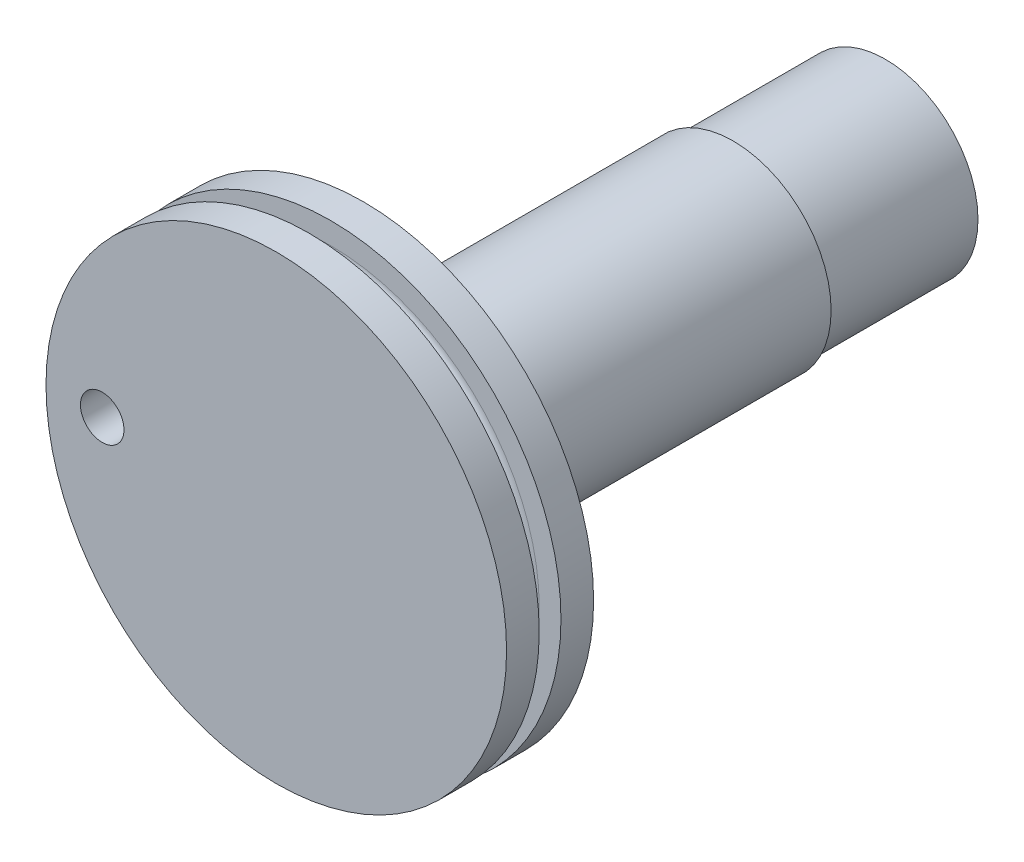
ISO-10303-21;
HEADER;
FILE_DESCRIPTION(('STEP AP214'),'2;1');
FILE_NAME('part.step','',(''),(''),'','','');
FILE_SCHEMA(('AUTOMOTIVE_DESIGN { 1 0 10303 214 1 1 1 1 }'));
ENDSEC;
DATA;
#1=APPLICATION_CONTEXT('core data for automotive mechanical design processes');
#2=APPLICATION_PROTOCOL_DEFINITION('international standard','automotive_design',2000,#1);
#3=PRODUCT_CONTEXT('',#1,'mechanical');
#4=PRODUCT('Part','Part','',(#3));
#5=PRODUCT_RELATED_PRODUCT_CATEGORY('part','',(#4));
#6=PRODUCT_DEFINITION_FORMATION('','',#4);
#7=PRODUCT_DEFINITION_CONTEXT('part definition',#1,'design');
#8=PRODUCT_DEFINITION('design','',#6,#7);
#9=PRODUCT_DEFINITION_SHAPE('','',#8);
#10=(LENGTH_UNIT() NAMED_UNIT(*) SI_UNIT(.MILLI.,.METRE.));
#11=(NAMED_UNIT(*) PLANE_ANGLE_UNIT() SI_UNIT($,.RADIAN.));
#12=(NAMED_UNIT(*) SI_UNIT($,.STERADIAN.) SOLID_ANGLE_UNIT());
#13=UNCERTAINTY_MEASURE_WITH_UNIT(LENGTH_MEASURE(1.E-05),#10,'distance_accuracy_value','');
#14=(GEOMETRIC_REPRESENTATION_CONTEXT(3) GLOBAL_UNCERTAINTY_ASSIGNED_CONTEXT((#13)) GLOBAL_UNIT_ASSIGNED_CONTEXT((#10,
#11,#12)) REPRESENTATION_CONTEXT('',''));
#15=CARTESIAN_POINT('',(0.,0.,0.));
#16=DIRECTION('',(0.,0.,1.));
#17=DIRECTION('',(1.,0.,0.));
#18=AXIS2_PLACEMENT_3D('',#15,#16,#17);
#19=CARTESIAN_POINT('',(21.,71.5,28.));
#20=DIRECTION('',(0.,0.,-1.));
#21=DIRECTION('',(-1.,0.,0.));
#22=AXIS2_PLACEMENT_3D('',#19,#20,#21);
#23=CYLINDRICAL_SURFACE('',#22,4.5);
#24=CARTESIAN_POINT('',(21.,71.5,7.));
#25=DIRECTION('',(0.,0.,1.));
#26=DIRECTION('',(1.,0.,0.));
#27=AXIS2_PLACEMENT_3D('',#24,#25,#26);
#28=CIRCLE('',#27,4.5);
#29=CARTESIAN_POINT('',(25.5,71.5,7.));
#30=VERTEX_POINT('',#29);
#31=EDGE_CURVE('E46',#30,#30,#28,.T.);
#32=ORIENTED_EDGE('',*,*,#31,.T.);
#33=EDGE_LOOP('',(#32));
#34=FACE_BOUND('',#33,.T.);
#35=CARTESIAN_POINT('',(21.,71.5,24.));
#36=DIRECTION('',(0.,0.,1.));
#37=DIRECTION('',(1.,0.,0.));
#38=AXIS2_PLACEMENT_3D('',#35,#36,#37);
#39=CIRCLE('',#38,4.5);
#40=CARTESIAN_POINT('',(25.5,71.5,24.));
#41=VERTEX_POINT('',#40);
#42=EDGE_CURVE('E10',#41,#41,#39,.T.);
#43=ORIENTED_EDGE('',*,*,#42,.F.);
#44=EDGE_LOOP('',(#43));
#45=FACE_BOUND('',#44,.T.);
#46=ADVANCED_FACE('F30',(#34,#45),#23,.T.);
#47=CARTESIAN_POINT('',(21.,71.5,7.));
#48=DIRECTION('',(0.,0.,-1.));
#49=DIRECTION('',(-1.,0.,0.));
#50=AXIS2_PLACEMENT_3D('',#47,#48,#49);
#51=CYLINDRICAL_SURFACE('',#50,4.25);
#52=CARTESIAN_POINT('',(21.,71.5,7.));
#53=DIRECTION('',(0.,0.,1.));
#54=DIRECTION('',(1.,0.,0.));
#55=AXIS2_PLACEMENT_3D('',#52,#53,#54);
#56=CIRCLE('',#55,4.25);
#57=CARTESIAN_POINT('',(25.25,71.5,7.));
#58=VERTEX_POINT('',#57);
#59=EDGE_CURVE('E37',#58,#58,#56,.T.);
#60=ORIENTED_EDGE('',*,*,#59,.F.);
#61=EDGE_LOOP('',(#60));
#62=FACE_BOUND('',#61,.T.);
#63=CARTESIAN_POINT('',(21.,71.5,0.));
#64=DIRECTION('',(0.,0.,1.));
#65=DIRECTION('',(1.,0.,0.));
#66=AXIS2_PLACEMENT_3D('',#63,#64,#65);
#67=CIRCLE('',#66,4.25);
#68=CARTESIAN_POINT('',(25.25,71.5,0.));
#69=VERTEX_POINT('',#68);
#70=EDGE_CURVE('E41',#69,#69,#67,.T.);
#71=ORIENTED_EDGE('',*,*,#70,.T.);
#72=EDGE_LOOP('',(#71));
#73=FACE_BOUND('',#72,.T.);
#74=ADVANCED_FACE('F32',(#62,#73),#51,.T.);
#75=CARTESIAN_POINT('',(21.,71.5,0.));
#76=DIRECTION('',(0.,0.,1.));
#77=DIRECTION('',(1.,0.,0.));
#78=AXIS2_PLACEMENT_3D('',#75,#76,#77);
#79=PLANE('',#78);
#80=ORIENTED_EDGE('',*,*,#70,.F.);
#81=EDGE_LOOP('',(#80));
#82=FACE_BOUND('',#81,.T.);
#83=ADVANCED_FACE('F94',(#82),#79,.F.);
#84=CARTESIAN_POINT('',(21.,71.5,7.));
#85=DIRECTION('',(0.,0.,1.));
#86=DIRECTION('',(1.,0.,0.));
#87=AXIS2_PLACEMENT_3D('',#84,#85,#86);
#88=PLANE('',#87);
#89=ORIENTED_EDGE('',*,*,#59,.T.);
#90=EDGE_LOOP('',(#89));
#91=FACE_BOUND('',#90,.T.);
#92=ORIENTED_EDGE('',*,*,#31,.F.);
#93=EDGE_LOOP('',(#92));
#94=FACE_BOUND('',#93,.T.);
#95=ADVANCED_FACE('F87',(#91,#94),#88,.F.);
#96=CARTESIAN_POINT('',(21.,71.5,-5.93517301250234));
#97=DIRECTION('',(0.,0.,1.));
#98=DIRECTION('',(1.,0.,0.));
#99=AXIS2_PLACEMENT_3D('',#96,#97,#98);
#100=CYLINDRICAL_SURFACE('',#99,10.5836819165665);
#101=CARTESIAN_POINT('',(21.,71.5,25.5));
#102=DIRECTION('',(0.,0.,1.));
#103=DIRECTION('',(1.,0.,0.));
#104=AXIS2_PLACEMENT_3D('',#101,#102,#103);
#105=CIRCLE('',#104,10.5836819165665);
#106=CARTESIAN_POINT('',(31.5836819165665,71.5,25.5));
#107=VERTEX_POINT('',#106);
#108=EDGE_CURVE('E59',#107,#107,#105,.T.);
#109=ORIENTED_EDGE('',*,*,#108,.F.);
#110=EDGE_LOOP('',(#109));
#111=FACE_BOUND('',#110,.T.);
#112=CARTESIAN_POINT('',(21.,71.5,24.));
#113=DIRECTION('',(0.,0.,1.));
#114=DIRECTION('',(1.,0.,0.));
#115=AXIS2_PLACEMENT_3D('',#112,#113,#114);
#116=CIRCLE('',#115,10.5836819165665);
#117=CARTESIAN_POINT('',(31.5836819165665,71.5,24.));
#118=VERTEX_POINT('',#117);
#119=EDGE_CURVE('E50',#118,#118,#116,.F.);
#120=ORIENTED_EDGE('',*,*,#119,.F.);
#121=EDGE_LOOP('',(#120));
#122=FACE_BOUND('',#121,.T.);
#123=ADVANCED_FACE('F81',(#111,#122),#100,.T.);
#124=CARTESIAN_POINT('',(92.5000000000001,47.5000000000003,24.));
#125=DIRECTION('',(0.,0.,1.));
#126=DIRECTION('',(1.,0.,0.));
#127=AXIS2_PLACEMENT_3D('',#124,#125,#126);
#128=PLANE('',#127);
#129=CARTESIAN_POINT('',(13.,71.5,24.));
#130=DIRECTION('',(0.,0.,-1.));
#131=DIRECTION('',(-1.,0.,0.));
#132=AXIS2_PLACEMENT_3D('',#129,#130,#131);
#133=CIRCLE('',#132,1.00000000000005);
#134=CARTESIAN_POINT('',(12.,71.5,24.));
#135=VERTEX_POINT('',#134);
#136=EDGE_CURVE('E71',#135,#135,#133,.T.);
#137=ORIENTED_EDGE('',*,*,#136,.F.);
#138=EDGE_LOOP('',(#137));
#139=FACE_BOUND('',#138,.T.);
#140=ORIENTED_EDGE('',*,*,#42,.T.);
#141=EDGE_LOOP('',(#140));
#142=FACE_BOUND('',#141,.T.);
#143=ORIENTED_EDGE('',*,*,#119,.T.);
#144=EDGE_LOOP('',(#143));
#145=FACE_BOUND('',#144,.T.);
#146=ADVANCED_FACE('F78',(#139,#142,#145),#128,.F.);
#147=CARTESIAN_POINT('',(31.5836819165665,71.5,26.5));
#148=DIRECTION('',(0.,0.,1.));
#149=DIRECTION('',(1.,0.,0.));
#150=AXIS2_PLACEMENT_3D('',#147,#148,#149);
#151=PLANE('',#150);
#152=CARTESIAN_POINT('',(21.,71.5,26.5));
#153=DIRECTION('',(0.,0.,1.));
#154=DIRECTION('',(1.,0.,0.));
#155=AXIS2_PLACEMENT_3D('',#152,#153,#154);
#156=CIRCLE('',#155,10.5836819165665);
#157=CARTESIAN_POINT('',(31.5836819165665,71.5,26.5));
#158=VERTEX_POINT('',#157);
#159=EDGE_CURVE('E56',#158,#158,#156,.T.);
#160=ORIENTED_EDGE('',*,*,#159,.F.);
#161=EDGE_LOOP('',(#160));
#162=FACE_BOUND('',#161,.T.);
#163=CARTESIAN_POINT('',(21.,71.5,26.5));
#164=DIRECTION('',(0.,0.,1.));
#165=DIRECTION('',(1.,0.,0.));
#166=AXIS2_PLACEMENT_3D('',#163,#164,#165);
#167=CIRCLE('',#166,9.58368191656646);
#168=CARTESIAN_POINT('',(30.5836819165665,71.5,26.5));
#169=VERTEX_POINT('',#168);
#170=EDGE_CURVE('E65',#169,#169,#167,.T.);
#171=ORIENTED_EDGE('',*,*,#170,.T.);
#172=EDGE_LOOP('',(#171));
#173=FACE_BOUND('',#172,.T.);
#174=ADVANCED_FACE('F80',(#162,#173),#151,.F.);
#175=CARTESIAN_POINT('',(31.5836819165665,71.5,25.5));
#176=DIRECTION('',(0.,0.,-1.));
#177=DIRECTION('',(-1.,0.,0.));
#178=AXIS2_PLACEMENT_3D('',#175,#176,#177);
#179=PLANE('',#178);
#180=CARTESIAN_POINT('',(21.,71.5,25.5));
#181=DIRECTION('',(0.,0.,1.));
#182=DIRECTION('',(1.,0.,0.));
#183=AXIS2_PLACEMENT_3D('',#180,#181,#182);
#184=CIRCLE('',#183,9.58368191656646);
#185=CARTESIAN_POINT('',(30.5836819165665,71.5,25.5));
#186=VERTEX_POINT('',#185);
#187=EDGE_CURVE('E62',#186,#186,#184,.T.);
#188=ORIENTED_EDGE('',*,*,#187,.F.);
#189=EDGE_LOOP('',(#188));
#190=FACE_BOUND('',#189,.T.);
#191=ORIENTED_EDGE('',*,*,#108,.T.);
#192=EDGE_LOOP('',(#191));
#193=FACE_BOUND('',#192,.T.);
#194=ADVANCED_FACE('F140',(#190,#193),#179,.F.);
#195=CARTESIAN_POINT('',(21.,71.5,26.));
#196=DIRECTION('',(0.,0.,1.));
#197=DIRECTION('',(1.,0.,0.));
#198=AXIS2_PLACEMENT_3D('',#195,#196,#197);
#199=TOROIDAL_SURFACE('',#198,9.58368191656646,0.499999999999997);
#200=ORIENTED_EDGE('',*,*,#170,.F.);
#201=EDGE_LOOP('',(#200));
#202=FACE_BOUND('',#201,.T.);
#203=ORIENTED_EDGE('',*,*,#187,.T.);
#204=EDGE_LOOP('',(#203));
#205=FACE_BOUND('',#204,.T.);
#206=ADVANCED_FACE('F151',(#202,#205),#199,.F.);
#207=CARTESIAN_POINT('',(21.,71.5,28.));
#208=DIRECTION('',(0.,0.,1.));
#209=DIRECTION('',(1.,0.,0.));
#210=AXIS2_PLACEMENT_3D('',#207,#208,#209);
#211=PLANE('',#210);
#212=CARTESIAN_POINT('',(13.,71.5,28.));
#213=DIRECTION('',(0.,0.,1.));
#214=DIRECTION('',(1.,0.,0.));
#215=AXIS2_PLACEMENT_3D('',#212,#213,#214);
#216=CIRCLE('',#215,1.00000000000005);
#217=CARTESIAN_POINT('',(14.,71.5,28.));
#218=VERTEX_POINT('',#217);
#219=EDGE_CURVE('E68',#218,#218,#216,.F.);
#220=ORIENTED_EDGE('',*,*,#219,.T.);
#221=EDGE_LOOP('',(#220));
#222=FACE_BOUND('',#221,.T.);
#223=CARTESIAN_POINT('',(21.,71.5,28.));
#224=DIRECTION('',(0.,0.,1.));
#225=DIRECTION('',(1.,0.,0.));
#226=AXIS2_PLACEMENT_3D('',#223,#224,#225);
#227=CIRCLE('',#226,10.5836819165665);
#228=CARTESIAN_POINT('',(31.5836819165665,71.5,28.));
#229=VERTEX_POINT('',#228);
#230=EDGE_CURVE('E53',#229,#229,#227,.T.);
#231=ORIENTED_EDGE('',*,*,#230,.T.);
#232=EDGE_LOOP('',(#231));
#233=FACE_BOUND('',#232,.T.);
#234=ADVANCED_FACE('F99',(#222,#233),#211,.T.);
#235=ORIENTED_EDGE('',*,*,#159,.T.);
#236=EDGE_LOOP('',(#235));
#237=FACE_BOUND('',#236,.T.);
#238=ORIENTED_EDGE('',*,*,#230,.F.);
#239=EDGE_LOOP('',(#238));
#240=FACE_BOUND('',#239,.T.);
#241=ADVANCED_FACE('F90',(#237,#240),#100,.T.);
#242=CARTESIAN_POINT('',(13.,71.5,30.8284271247463));
#243=DIRECTION('',(0.,0.,-1.));
#244=DIRECTION('',(-1.,0.,0.));
#245=AXIS2_PLACEMENT_3D('',#242,#243,#244);
#246=CYLINDRICAL_SURFACE('',#245,1.00000000000005);
#247=ORIENTED_EDGE('',*,*,#136,.T.);
#248=EDGE_LOOP('',(#247));
#249=FACE_BOUND('',#248,.T.);
#250=ORIENTED_EDGE('',*,*,#219,.F.);
#251=EDGE_LOOP('',(#250));
#252=FACE_BOUND('',#251,.T.);
#253=ADVANCED_FACE('F75',(#249,#252),#246,.F.);
#254=CLOSED_SHELL('',(#46,#74,#83,#95,#123,#146,#174,#194,#206,#234,#241,#253));
#255=MANIFOLD_SOLID_BREP('B2',#254);
#256=ADVANCED_BREP_SHAPE_REPRESENTATION('',(#18,#255),#14);
#257=SHAPE_DEFINITION_REPRESENTATION(#9,#256);
ENDSEC;
END-ISO-10303-21;
